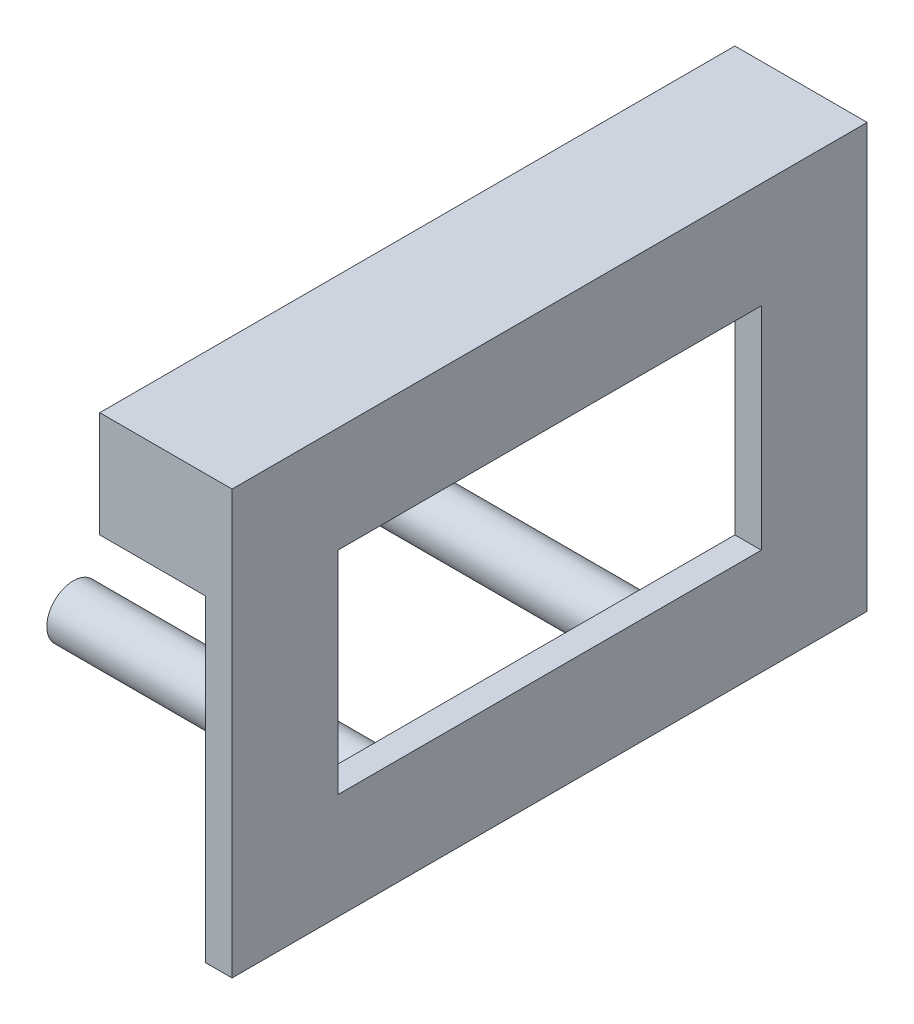
ISO-10303-21;
HEADER;
FILE_DESCRIPTION(('STEP AP214'),'2;1');
FILE_NAME('part.step','',(''),(''),'','','');
FILE_SCHEMA(('AUTOMOTIVE_DESIGN { 1 0 10303 214 1 1 1 1 }'));
ENDSEC;
DATA;
#1=APPLICATION_CONTEXT('core data for automotive mechanical design processes');
#2=APPLICATION_PROTOCOL_DEFINITION('international standard','automotive_design',2000,#1);
#3=PRODUCT_CONTEXT('',#1,'mechanical');
#4=PRODUCT('Part','Part','',(#3));
#5=PRODUCT_RELATED_PRODUCT_CATEGORY('part','',(#4));
#6=PRODUCT_DEFINITION_FORMATION('','',#4);
#7=PRODUCT_DEFINITION_CONTEXT('part definition',#1,'design');
#8=PRODUCT_DEFINITION('design','',#6,#7);
#9=PRODUCT_DEFINITION_SHAPE('','',#8);
#10=(LENGTH_UNIT() NAMED_UNIT(*) SI_UNIT(.MILLI.,.METRE.));
#11=(NAMED_UNIT(*) PLANE_ANGLE_UNIT() SI_UNIT($,.RADIAN.));
#12=(NAMED_UNIT(*) SI_UNIT($,.STERADIAN.) SOLID_ANGLE_UNIT());
#13=UNCERTAINTY_MEASURE_WITH_UNIT(LENGTH_MEASURE(1.E-05),#10,'distance_accuracy_value','');
#14=(GEOMETRIC_REPRESENTATION_CONTEXT(3) GLOBAL_UNCERTAINTY_ASSIGNED_CONTEXT((#13)) GLOBAL_UNIT_ASSIGNED_CONTEXT((#10,
#11,#12)) REPRESENTATION_CONTEXT('',''));
#15=CARTESIAN_POINT('',(0.,0.,0.));
#16=DIRECTION('',(0.,0.,1.));
#17=DIRECTION('',(1.,0.,0.));
#18=AXIS2_PLACEMENT_3D('',#15,#16,#17);
#19=CARTESIAN_POINT('',(2.5,0.,0.));
#20=DIRECTION('',(1.,0.,0.));
#21=DIRECTION('',(0.,0.,1.));
#22=AXIS2_PLACEMENT_3D('',#19,#20,#21);
#23=PLANE('',#22);
#24=CARTESIAN_POINT('',(2.5,5.,-2.50000000000003));
#25=DIRECTION('',(-1.,0.,0.));
#26=DIRECTION('',(0.,0.,1.));
#27=AXIS2_PLACEMENT_3D('',#24,#25,#26);
#28=CIRCLE('',#27,2.5);
#29=CARTESIAN_POINT('',(2.5,5.,0.));
#30=VERTEX_POINT('',#29);
#31=EDGE_CURVE('E11',#30,#30,#28,.F.);
#32=ORIENTED_EDGE('',*,*,#31,.T.);
#33=EDGE_LOOP('',(#32));
#34=FACE_BOUND('',#33,.T.);
#35=CARTESIAN_POINT('',(2.5,5.,22.5));
#36=DIRECTION('',(-1.,0.,0.));
#37=DIRECTION('',(0.,0.,1.));
#38=AXIS2_PLACEMENT_3D('',#35,#36,#37);
#39=CIRCLE('',#38,2.5);
#40=CARTESIAN_POINT('',(2.5,5.,25.));
#41=VERTEX_POINT('',#40);
#42=EDGE_CURVE('E45',#41,#41,#39,.F.);
#43=ORIENTED_EDGE('',*,*,#42,.T.);
#44=EDGE_LOOP('',(#43));
#45=FACE_BOUND('',#44,.T.);
#46=DIRECTION('',(0.,0.,-1.));
#47=VECTOR('',#46,1.);
#48=CARTESIAN_POINT('',(2.5,30.,40.));
#49=LINE('',#48,#47);
#50=CARTESIAN_POINT('',(2.5,30.,40.));
#51=VERTEX_POINT('',#50);
#52=CARTESIAN_POINT('',(2.5,30.,30.));
#53=VERTEX_POINT('',#52);
#54=EDGE_CURVE('E246',#51,#53,#49,.T.);
#55=ORIENTED_EDGE('',*,*,#54,.T.);
#56=DIRECTION('',(0.,1.,0.));
#57=VECTOR('',#56,1.);
#58=CARTESIAN_POINT('',(2.5,0.,30.));
#59=LINE('',#58,#57);
#60=CARTESIAN_POINT('',(2.5,10.,30.));
#61=VERTEX_POINT('',#60);
#62=EDGE_CURVE('E168',#61,#53,#59,.T.);
#63=ORIENTED_EDGE('',*,*,#62,.F.);
#64=DIRECTION('',(0.,0.,1.));
#65=VECTOR('',#64,1.);
#66=CARTESIAN_POINT('',(2.5,10.,0.));
#67=LINE('',#66,#65);
#68=CARTESIAN_POINT('',(2.5,9.99999999999999,-10.));
#69=VERTEX_POINT('',#68);
#70=EDGE_CURVE('E165',#69,#61,#67,.T.);
#71=ORIENTED_EDGE('',*,*,#70,.F.);
#72=DIRECTION('',(0.,-1.,0.));
#73=VECTOR('',#72,1.);
#74=CARTESIAN_POINT('',(2.5,0.,-10.));
#75=LINE('',#74,#73);
#76=CARTESIAN_POINT('',(2.5,30.,-10.));
#77=VERTEX_POINT('',#76);
#78=EDGE_CURVE('E171',#77,#69,#75,.T.);
#79=ORIENTED_EDGE('',*,*,#78,.F.);
#80=CARTESIAN_POINT('',(2.5,30.,-20.));
#81=VERTEX_POINT('',#80);
#82=EDGE_CURVE('E133',#77,#81,#49,.T.);
#83=ORIENTED_EDGE('',*,*,#82,.T.);
#84=DIRECTION('',(0.,1.,0.));
#85=VECTOR('',#84,1.);
#86=CARTESIAN_POINT('',(2.5,0.,-20.));
#87=LINE('',#86,#85);
#88=CARTESIAN_POINT('',(2.5,0.,-20.));
#89=VERTEX_POINT('',#88);
#90=EDGE_CURVE('E138',#89,#81,#87,.T.);
#91=ORIENTED_EDGE('',*,*,#90,.F.);
#92=DIRECTION('',(0.,0.,-1.));
#93=VECTOR('',#92,1.);
#94=CARTESIAN_POINT('',(2.5,0.,-40.));
#95=LINE('',#94,#93);
#96=CARTESIAN_POINT('',(2.5,0.,40.));
#97=VERTEX_POINT('',#96);
#98=EDGE_CURVE('E150',#97,#89,#95,.T.);
#99=ORIENTED_EDGE('',*,*,#98,.F.);
#100=DIRECTION('',(0.,-1.,0.));
#101=VECTOR('',#100,1.);
#102=CARTESIAN_POINT('',(2.5,0.,40.));
#103=LINE('',#102,#101);
#104=EDGE_CURVE('E141',#51,#97,#103,.T.);
#105=ORIENTED_EDGE('',*,*,#104,.F.);
#106=EDGE_LOOP('',(#55,#63,#71,#79,#83,#91,#99,#105));
#107=FACE_BOUND('',#106,.T.);
#108=ADVANCED_FACE('F37',(#34,#45,#107),#23,.F.);
#109=CARTESIAN_POINT('',(-2.5,0.,40.));
#110=DIRECTION('',(0.,0.,-1.));
#111=DIRECTION('',(1.,0.,0.));
#112=AXIS2_PLACEMENT_3D('',#109,#110,#111);
#113=PLANE('',#112);
#114=ORIENTED_EDGE('',*,*,#104,.T.);
#115=DIRECTION('',(1.,0.,0.));
#116=VECTOR('',#115,1.);
#117=CARTESIAN_POINT('',(-2.5,0.,40.));
#118=LINE('',#117,#116);
#119=CARTESIAN_POINT('',(5.,0.,40.));
#120=VERTEX_POINT('',#119);
#121=EDGE_CURVE('E162',#97,#120,#118,.T.);
#122=ORIENTED_EDGE('',*,*,#121,.T.);
#123=DIRECTION('',(0.,-1.,0.));
#124=VECTOR('',#123,1.);
#125=CARTESIAN_POINT('',(5.,0.,40.));
#126=LINE('',#125,#124);
#127=CARTESIAN_POINT('',(5.,40.,40.));
#128=VERTEX_POINT('',#127);
#129=EDGE_CURVE('E153',#128,#120,#126,.T.);
#130=ORIENTED_EDGE('',*,*,#129,.F.);
#131=DIRECTION('',(1.,0.,0.));
#132=VECTOR('',#131,1.);
#133=CARTESIAN_POINT('',(-2.5,40.,40.));
#134=LINE('',#133,#132);
#135=CARTESIAN_POINT('',(-7.5,40.,40.));
#136=VERTEX_POINT('',#135);
#137=EDGE_CURVE('E160',#136,#128,#134,.T.);
#138=ORIENTED_EDGE('',*,*,#137,.F.);
#139=DIRECTION('',(0.,-1.,0.));
#140=VECTOR('',#139,1.);
#141=CARTESIAN_POINT('',(-7.5,35.,40.));
#142=LINE('',#141,#140);
#143=CARTESIAN_POINT('',(-7.5,30.,40.));
#144=VERTEX_POINT('',#143);
#145=EDGE_CURVE('E129',#136,#144,#142,.T.);
#146=ORIENTED_EDGE('',*,*,#145,.T.);
#147=DIRECTION('',(1.,0.,0.));
#148=VECTOR('',#147,1.);
#149=CARTESIAN_POINT('',(-7.5,30.,40.));
#150=LINE('',#149,#148);
#151=EDGE_CURVE('E52',#144,#51,#150,.T.);
#152=ORIENTED_EDGE('',*,*,#151,.T.);
#153=EDGE_LOOP('',(#114,#122,#130,#138,#146,#152));
#154=FACE_BOUND('',#153,.T.);
#155=ADVANCED_FACE('F39',(#154),#113,.F.);
#156=CARTESIAN_POINT('',(-2.5,0.,40.));
#157=DIRECTION('',(0.,1.,0.));
#158=DIRECTION('',(0.,0.,1.));
#159=AXIS2_PLACEMENT_3D('',#156,#157,#158);
#160=PLANE('',#159);
#161=DIRECTION('',(0.,0.,-1.));
#162=VECTOR('',#161,1.);
#163=CARTESIAN_POINT('',(5.,0.,40.));
#164=LINE('',#163,#162);
#165=CARTESIAN_POINT('',(5.,0.,-20.));
#166=VERTEX_POINT('',#165);
#167=EDGE_CURVE('E156',#120,#166,#164,.T.);
#168=ORIENTED_EDGE('',*,*,#167,.F.);
#169=ORIENTED_EDGE('',*,*,#121,.F.);
#170=ORIENTED_EDGE('',*,*,#98,.T.);
#171=DIRECTION('',(1.,0.,0.));
#172=VECTOR('',#171,1.);
#173=CARTESIAN_POINT('',(-5.,0.,-20.));
#174=LINE('',#173,#172);
#175=EDGE_CURVE('E139',#89,#166,#174,.T.);
#176=ORIENTED_EDGE('',*,*,#175,.T.);
#177=EDGE_LOOP('',(#168,#169,#170,#176));
#178=FACE_BOUND('',#177,.T.);
#179=ADVANCED_FACE('F199',(#178),#160,.F.);
#180=CARTESIAN_POINT('',(-2.5,40.,-40.));
#181=DIRECTION('',(0.,-1.,0.));
#182=DIRECTION('',(0.,0.,-1.));
#183=AXIS2_PLACEMENT_3D('',#180,#181,#182);
#184=PLANE('',#183);
#185=ORIENTED_EDGE('',*,*,#137,.T.);
#186=DIRECTION('',(0.,0.,1.));
#187=VECTOR('',#186,1.);
#188=CARTESIAN_POINT('',(5.,40.,-40.));
#189=LINE('',#188,#187);
#190=CARTESIAN_POINT('',(5.,40.,-20.));
#191=VERTEX_POINT('',#190);
#192=EDGE_CURVE('E137',#191,#128,#189,.T.);
#193=ORIENTED_EDGE('',*,*,#192,.F.);
#194=DIRECTION('',(1.,0.,0.));
#195=VECTOR('',#194,1.);
#196=CARTESIAN_POINT('',(-5.,40.,-20.));
#197=LINE('',#196,#195);
#198=CARTESIAN_POINT('',(-7.5,40.,-20.));
#199=VERTEX_POINT('',#198);
#200=EDGE_CURVE('E121',#199,#191,#197,.T.);
#201=ORIENTED_EDGE('',*,*,#200,.F.);
#202=DIRECTION('',(0.,0.,1.));
#203=VECTOR('',#202,1.);
#204=CARTESIAN_POINT('',(-7.5,40.,40.));
#205=LINE('',#204,#203);
#206=EDGE_CURVE('E127',#199,#136,#205,.T.);
#207=ORIENTED_EDGE('',*,*,#206,.T.);
#208=EDGE_LOOP('',(#185,#193,#201,#207));
#209=FACE_BOUND('',#208,.T.);
#210=ADVANCED_FACE('F136',(#209),#184,.F.);
#211=CARTESIAN_POINT('',(5.,0.,0.));
#212=DIRECTION('',(-1.,0.,0.));
#213=DIRECTION('',(0.,0.,-1.));
#214=AXIS2_PLACEMENT_3D('',#211,#212,#213);
#215=PLANE('',#214);
#216=DIRECTION('',(0.,0.,1.));
#217=VECTOR('',#216,1.);
#218=CARTESIAN_POINT('',(5.,10.,30.));
#219=LINE('',#218,#217);
#220=CARTESIAN_POINT('',(5.,9.99999999999999,-10.));
#221=VERTEX_POINT('',#220);
#222=CARTESIAN_POINT('',(5.,10.,30.));
#223=VERTEX_POINT('',#222);
#224=EDGE_CURVE('E237',#221,#223,#219,.T.);
#225=ORIENTED_EDGE('',*,*,#224,.T.);
#226=DIRECTION('',(0.,1.,0.));
#227=VECTOR('',#226,1.);
#228=CARTESIAN_POINT('',(5.,10.,30.));
#229=LINE('',#228,#227);
#230=CARTESIAN_POINT('',(5.,30.,30.));
#231=VERTEX_POINT('',#230);
#232=EDGE_CURVE('E235',#223,#231,#229,.T.);
#233=ORIENTED_EDGE('',*,*,#232,.T.);
#234=DIRECTION('',(0.,0.,-1.));
#235=VECTOR('',#234,1.);
#236=CARTESIAN_POINT('',(5.,30.,30.));
#237=LINE('',#236,#235);
#238=CARTESIAN_POINT('',(5.,30.,-10.));
#239=VERTEX_POINT('',#238);
#240=EDGE_CURVE('E228',#231,#239,#237,.T.);
#241=ORIENTED_EDGE('',*,*,#240,.T.);
#242=DIRECTION('',(0.,-1.,0.));
#243=VECTOR('',#242,1.);
#244=CARTESIAN_POINT('',(5.,9.99999999999999,-10.));
#245=LINE('',#244,#243);
#246=EDGE_CURVE('E240',#239,#221,#245,.T.);
#247=ORIENTED_EDGE('',*,*,#246,.T.);
#248=EDGE_LOOP('',(#225,#233,#241,#247));
#249=FACE_BOUND('',#248,.T.);
#250=ORIENTED_EDGE('',*,*,#192,.T.);
#251=ORIENTED_EDGE('',*,*,#129,.T.);
#252=ORIENTED_EDGE('',*,*,#167,.T.);
#253=DIRECTION('',(0.,1.,0.));
#254=VECTOR('',#253,1.);
#255=CARTESIAN_POINT('',(5.,40.,-20.));
#256=LINE('',#255,#254);
#257=EDGE_CURVE('E144',#166,#191,#256,.T.);
#258=ORIENTED_EDGE('',*,*,#257,.T.);
#259=EDGE_LOOP('',(#250,#251,#252,#258));
#260=FACE_BOUND('',#259,.T.);
#261=ADVANCED_FACE('F203',(#249,#260),#215,.F.);
#262=CARTESIAN_POINT('',(-5.,40.,-20.));
#263=DIRECTION('',(0.,0.,1.));
#264=DIRECTION('',(0.,-1.,0.));
#265=AXIS2_PLACEMENT_3D('',#262,#263,#264);
#266=PLANE('',#265);
#267=ORIENTED_EDGE('',*,*,#200,.T.);
#268=ORIENTED_EDGE('',*,*,#257,.F.);
#269=ORIENTED_EDGE('',*,*,#175,.F.);
#270=ORIENTED_EDGE('',*,*,#90,.T.);
#271=DIRECTION('',(1.,0.,0.));
#272=VECTOR('',#271,1.);
#273=CARTESIAN_POINT('',(-7.5,30.,-20.));
#274=LINE('',#273,#272);
#275=CARTESIAN_POINT('',(-7.5,30.,-20.));
#276=VERTEX_POINT('',#275);
#277=EDGE_CURVE('E60',#276,#81,#274,.T.);
#278=ORIENTED_EDGE('',*,*,#277,.F.);
#279=DIRECTION('',(0.,1.,0.));
#280=VECTOR('',#279,1.);
#281=CARTESIAN_POINT('',(-7.5,35.,-20.));
#282=LINE('',#281,#280);
#283=EDGE_CURVE('E117',#276,#199,#282,.T.);
#284=ORIENTED_EDGE('',*,*,#283,.T.);
#285=EDGE_LOOP('',(#267,#268,#269,#270,#278,#284));
#286=FACE_BOUND('',#285,.T.);
#287=ADVANCED_FACE('F119',(#286),#266,.F.);
#288=CARTESIAN_POINT('',(-5.,9.99999999999999,-10.));
#289=DIRECTION('',(0.,0.,-1.));
#290=DIRECTION('',(1.,0.,0.));
#291=AXIS2_PLACEMENT_3D('',#288,#289,#290);
#292=PLANE('',#291);
#293=DIRECTION('',(1.,0.,0.));
#294=VECTOR('',#293,1.);
#295=CARTESIAN_POINT('',(-5.,30.,-10.));
#296=LINE('',#295,#294);
#297=EDGE_CURVE('E220',#77,#239,#296,.T.);
#298=ORIENTED_EDGE('',*,*,#297,.F.);
#299=ORIENTED_EDGE('',*,*,#78,.T.);
#300=DIRECTION('',(1.,0.,0.));
#301=VECTOR('',#300,1.);
#302=CARTESIAN_POINT('',(-5.,9.99999999999999,-10.));
#303=LINE('',#302,#301);
#304=EDGE_CURVE('E231',#69,#221,#303,.T.);
#305=ORIENTED_EDGE('',*,*,#304,.T.);
#306=ORIENTED_EDGE('',*,*,#246,.F.);
#307=EDGE_LOOP('',(#298,#299,#305,#306));
#308=FACE_BOUND('',#307,.T.);
#309=ADVANCED_FACE('F310',(#308),#292,.F.);
#310=CARTESIAN_POINT('',(-5.,30.,30.));
#311=DIRECTION('',(0.,1.,0.));
#312=DIRECTION('',(0.,0.,1.));
#313=AXIS2_PLACEMENT_3D('',#310,#311,#312);
#314=PLANE('',#313);
#315=DIRECTION('',(1.,0.,0.));
#316=VECTOR('',#315,1.);
#317=CARTESIAN_POINT('',(-5.,30.,30.));
#318=LINE('',#317,#316);
#319=EDGE_CURVE('E221',#53,#231,#318,.T.);
#320=ORIENTED_EDGE('',*,*,#319,.F.);
#321=ORIENTED_EDGE('',*,*,#54,.F.);
#322=ORIENTED_EDGE('',*,*,#151,.F.);
#323=DIRECTION('',(0.,0.,-1.));
#324=VECTOR('',#323,1.);
#325=CARTESIAN_POINT('',(-7.5,30.,40.));
#326=LINE('',#325,#324);
#327=EDGE_CURVE('E124',#144,#276,#326,.T.);
#328=ORIENTED_EDGE('',*,*,#327,.T.);
#329=ORIENTED_EDGE('',*,*,#277,.T.);
#330=ORIENTED_EDGE('',*,*,#82,.F.);
#331=ORIENTED_EDGE('',*,*,#297,.T.);
#332=ORIENTED_EDGE('',*,*,#240,.F.);
#333=EDGE_LOOP('',(#320,#321,#322,#328,#329,#330,#331,#332));
#334=FACE_BOUND('',#333,.T.);
#335=ADVANCED_FACE('F300',(#334),#314,.F.);
#336=CARTESIAN_POINT('',(-5.,10.,30.));
#337=DIRECTION('',(0.,0.,1.));
#338=DIRECTION('',(-1.,0.,0.));
#339=AXIS2_PLACEMENT_3D('',#336,#337,#338);
#340=PLANE('',#339);
#341=DIRECTION('',(1.,0.,0.));
#342=VECTOR('',#341,1.);
#343=CARTESIAN_POINT('',(-5.,10.,30.));
#344=LINE('',#343,#342);
#345=EDGE_CURVE('E225',#61,#223,#344,.T.);
#346=ORIENTED_EDGE('',*,*,#345,.F.);
#347=ORIENTED_EDGE('',*,*,#62,.T.);
#348=ORIENTED_EDGE('',*,*,#319,.T.);
#349=ORIENTED_EDGE('',*,*,#232,.F.);
#350=EDGE_LOOP('',(#346,#347,#348,#349));
#351=FACE_BOUND('',#350,.T.);
#352=ADVANCED_FACE('F290',(#351),#340,.F.);
#353=CARTESIAN_POINT('',(-5.,10.,30.));
#354=DIRECTION('',(0.,-1.,0.));
#355=DIRECTION('',(0.,0.,-1.));
#356=AXIS2_PLACEMENT_3D('',#353,#354,#355);
#357=PLANE('',#356);
#358=ORIENTED_EDGE('',*,*,#304,.F.);
#359=ORIENTED_EDGE('',*,*,#70,.T.);
#360=ORIENTED_EDGE('',*,*,#345,.T.);
#361=ORIENTED_EDGE('',*,*,#224,.F.);
#362=EDGE_LOOP('',(#358,#359,#360,#361));
#363=FACE_BOUND('',#362,.T.);
#364=ADVANCED_FACE('F190',(#363),#357,.F.);
#365=CARTESIAN_POINT('',(-7.5,0.,0.));
#366=DIRECTION('',(-1.,0.,0.));
#367=DIRECTION('',(0.,0.,-1.));
#368=AXIS2_PLACEMENT_3D('',#365,#366,#367);
#369=PLANE('',#368);
#370=ORIENTED_EDGE('',*,*,#145,.F.);
#371=ORIENTED_EDGE('',*,*,#206,.F.);
#372=ORIENTED_EDGE('',*,*,#283,.F.);
#373=ORIENTED_EDGE('',*,*,#327,.F.);
#374=EDGE_LOOP('',(#370,#371,#372,#373));
#375=FACE_BOUND('',#374,.T.);
#376=ADVANCED_FACE('F128',(#375),#369,.T.);
#377=CARTESIAN_POINT('',(-27.5,5.,22.5));
#378=DIRECTION('',(1.,0.,0.));
#379=DIRECTION('',(0.,0.,1.));
#380=AXIS2_PLACEMENT_3D('',#377,#378,#379);
#381=CYLINDRICAL_SURFACE('',#380,2.5);
#382=CARTESIAN_POINT('',(-27.5,5.,22.5));
#383=DIRECTION('',(1.,0.,0.));
#384=DIRECTION('',(0.,0.,-1.));
#385=AXIS2_PLACEMENT_3D('',#382,#383,#384);
#386=CIRCLE('',#385,2.5);
#387=CARTESIAN_POINT('',(-27.5,5.,20.));
#388=VERTEX_POINT('',#387);
#389=EDGE_CURVE('E134',#388,#388,#386,.T.);
#390=ORIENTED_EDGE('',*,*,#389,.T.);
#391=EDGE_LOOP('',(#390));
#392=FACE_BOUND('',#391,.T.);
#393=ORIENTED_EDGE('',*,*,#42,.F.);
#394=EDGE_LOOP('',(#393));
#395=FACE_BOUND('',#394,.T.);
#396=ADVANCED_FACE('F178',(#392,#395),#381,.T.);
#397=CARTESIAN_POINT('',(-27.5,5.,22.5));
#398=DIRECTION('',(-1.,0.,0.));
#399=DIRECTION('',(0.,0.,-1.));
#400=AXIS2_PLACEMENT_3D('',#397,#398,#399);
#401=PLANE('',#400);
#402=ORIENTED_EDGE('',*,*,#389,.F.);
#403=EDGE_LOOP('',(#402));
#404=FACE_BOUND('',#403,.T.);
#405=ADVANCED_FACE('F180',(#404),#401,.T.);
#406=CARTESIAN_POINT('',(-27.5,5.,-2.50000000000003));
#407=DIRECTION('',(1.,0.,0.));
#408=DIRECTION('',(0.,0.,1.));
#409=AXIS2_PLACEMENT_3D('',#406,#407,#408);
#410=CYLINDRICAL_SURFACE('',#409,2.5);
#411=CARTESIAN_POINT('',(-27.5,5.,-2.50000000000003));
#412=DIRECTION('',(1.,0.,0.));
#413=DIRECTION('',(0.,0.,1.));
#414=AXIS2_PLACEMENT_3D('',#411,#412,#413);
#415=CIRCLE('',#414,2.5);
#416=CARTESIAN_POINT('',(-27.5,5.,0.));
#417=VERTEX_POINT('',#416);
#418=EDGE_CURVE('E251',#417,#417,#415,.T.);
#419=ORIENTED_EDGE('',*,*,#418,.T.);
#420=EDGE_LOOP('',(#419));
#421=FACE_BOUND('',#420,.T.);
#422=ORIENTED_EDGE('',*,*,#31,.F.);
#423=EDGE_LOOP('',(#422));
#424=FACE_BOUND('',#423,.T.);
#425=ADVANCED_FACE('F187',(#421,#424),#410,.T.);
#426=CARTESIAN_POINT('',(-27.5,5.,-2.50000000000003));
#427=DIRECTION('',(1.,0.,0.));
#428=DIRECTION('',(0.,0.,1.));
#429=AXIS2_PLACEMENT_3D('',#426,#427,#428);
#430=PLANE('',#429);
#431=ORIENTED_EDGE('',*,*,#418,.F.);
#432=EDGE_LOOP('',(#431));
#433=FACE_BOUND('',#432,.T.);
#434=ADVANCED_FACE('F257',(#433),#430,.F.);
#435=CLOSED_SHELL('',(#108,#155,#179,#210,#261,#287,#309,#335,#352,#364,#376,#396,#405,#425,#434));
#436=MANIFOLD_SOLID_BREP('B2',#435);
#437=ADVANCED_BREP_SHAPE_REPRESENTATION('',(#18,#436),#14);
#438=SHAPE_DEFINITION_REPRESENTATION(#9,#437);
ENDSEC;
END-ISO-10303-21;
